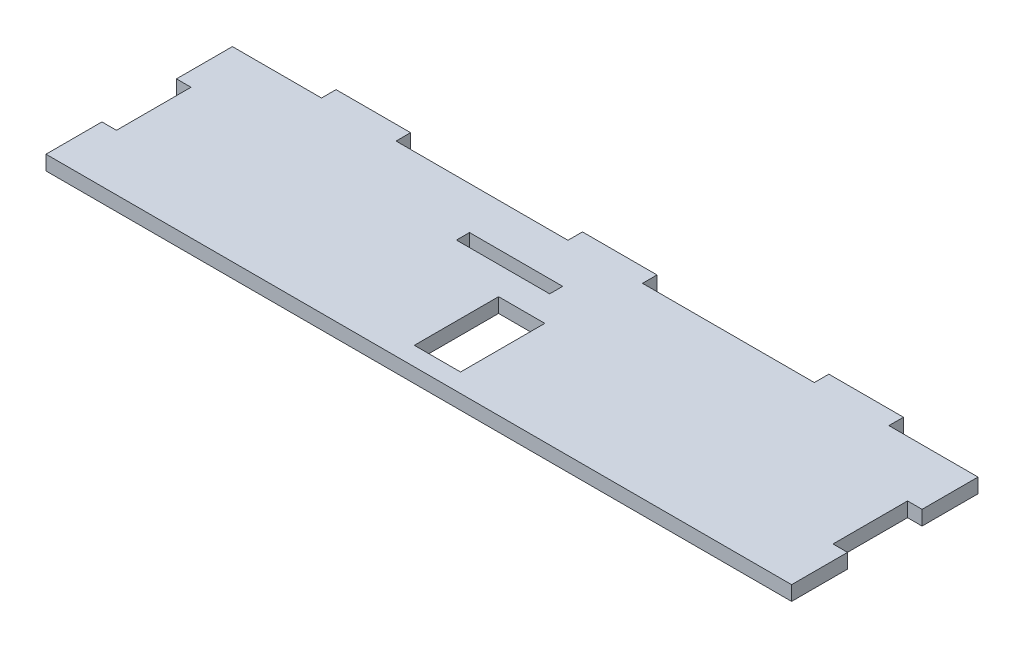
ISO-10303-21;
HEADER;
FILE_DESCRIPTION(('STEP AP214'),'2;1');
FILE_NAME('part.step','',(''),(''),'','','');
FILE_SCHEMA(('AUTOMOTIVE_DESIGN { 1 0 10303 214 1 1 1 1 }'));
ENDSEC;
DATA;
#1=APPLICATION_CONTEXT('core data for automotive mechanical design processes');
#2=APPLICATION_PROTOCOL_DEFINITION('international standard','automotive_design',2000,#1);
#3=PRODUCT_CONTEXT('',#1,'mechanical');
#4=PRODUCT('Part','Part','',(#3));
#5=PRODUCT_RELATED_PRODUCT_CATEGORY('part','',(#4));
#6=PRODUCT_DEFINITION_FORMATION('','',#4);
#7=PRODUCT_DEFINITION_CONTEXT('part definition',#1,'design');
#8=PRODUCT_DEFINITION('design','',#6,#7);
#9=PRODUCT_DEFINITION_SHAPE('','',#8);
#10=(LENGTH_UNIT() NAMED_UNIT(*) SI_UNIT(.MILLI.,.METRE.));
#11=(NAMED_UNIT(*) PLANE_ANGLE_UNIT() SI_UNIT($,.RADIAN.));
#12=(NAMED_UNIT(*) SI_UNIT($,.STERADIAN.) SOLID_ANGLE_UNIT());
#13=UNCERTAINTY_MEASURE_WITH_UNIT(LENGTH_MEASURE(1.E-05),#10,'distance_accuracy_value','');
#14=(GEOMETRIC_REPRESENTATION_CONTEXT(3) GLOBAL_UNCERTAINTY_ASSIGNED_CONTEXT((#13)) GLOBAL_UNIT_ASSIGNED_CONTEXT((#10,
#11,#12)) REPRESENTATION_CONTEXT('',''));
#15=CARTESIAN_POINT('',(0.,0.,0.));
#16=DIRECTION('',(0.,0.,1.));
#17=DIRECTION('',(1.,0.,0.));
#18=AXIS2_PLACEMENT_3D('',#15,#16,#17);
#19=CARTESIAN_POINT('',(0.,3.9,-13.6));
#20=DIRECTION('',(0.,0.,1.));
#21=DIRECTION('',(1.,0.,0.));
#22=AXIS2_PLACEMENT_3D('',#19,#20,#21);
#23=PLANE('',#22);
#24=DIRECTION('',(-1.,0.,0.));
#25=VECTOR('',#24,1.);
#26=CARTESIAN_POINT('',(0.,0.,-13.6));
#27=LINE('',#26,#25);
#28=CARTESIAN_POINT('',(0.,0.,-13.6));
#29=VERTEX_POINT('',#28);
#30=CARTESIAN_POINT('',(-25.,0.,-13.6));
#31=VERTEX_POINT('',#30);
#32=EDGE_CURVE('E497',#29,#31,#27,.T.);
#33=ORIENTED_EDGE('',*,*,#32,.F.);
#34=DIRECTION('',(0.,-1.,0.));
#35=VECTOR('',#34,1.);
#36=CARTESIAN_POINT('',(0.,3.9,-13.6));
#37=LINE('',#36,#35);
#38=CARTESIAN_POINT('',(0.,3.9,-13.6));
#39=VERTEX_POINT('',#38);
#40=EDGE_CURVE('E12',#39,#29,#37,.T.);
#41=ORIENTED_EDGE('',*,*,#40,.F.);
#42=DIRECTION('',(-1.,0.,0.));
#43=VECTOR('',#42,1.);
#44=CARTESIAN_POINT('',(0.,3.9,-13.6));
#45=LINE('',#44,#43);
#46=CARTESIAN_POINT('',(-25.,3.9,-13.6));
#47=VERTEX_POINT('',#46);
#48=EDGE_CURVE('E390',#39,#47,#45,.T.);
#49=ORIENTED_EDGE('',*,*,#48,.T.);
#50=DIRECTION('',(0.,-1.,0.));
#51=VECTOR('',#50,1.);
#52=CARTESIAN_POINT('',(-25.,3.9,-13.6));
#53=LINE('',#52,#51);
#54=EDGE_CURVE('E512',#47,#31,#53,.T.);
#55=ORIENTED_EDGE('',*,*,#54,.T.);
#56=EDGE_LOOP('',(#33,#41,#49,#55));
#57=FACE_BOUND('',#56,.T.);
#58=ADVANCED_FACE('F42',(#57),#23,.T.);
#59=CARTESIAN_POINT('',(0.,3.9,0.));
#60=DIRECTION('',(1.,0.,0.));
#61=DIRECTION('',(0.,0.,-1.));
#62=AXIS2_PLACEMENT_3D('',#59,#60,#61);
#63=PLANE('',#62);
#64=DIRECTION('',(0.,0.,1.));
#65=VECTOR('',#64,1.);
#66=CARTESIAN_POINT('',(0.,0.,0.));
#67=LINE('',#66,#65);
#68=CARTESIAN_POINT('',(0.,0.,-10.1));
#69=VERTEX_POINT('',#68);
#70=EDGE_CURVE('E501',#29,#69,#67,.T.);
#71=ORIENTED_EDGE('',*,*,#70,.T.);
#72=DIRECTION('',(0.,-1.,0.));
#73=VECTOR('',#72,1.);
#74=CARTESIAN_POINT('',(0.,3.9,-10.1));
#75=LINE('',#74,#73);
#76=CARTESIAN_POINT('',(0.,3.9,-10.1));
#77=VERTEX_POINT('',#76);
#78=EDGE_CURVE('E52',#77,#69,#75,.T.);
#79=ORIENTED_EDGE('',*,*,#78,.F.);
#80=DIRECTION('',(0.,0.,1.));
#81=VECTOR('',#80,1.);
#82=CARTESIAN_POINT('',(0.,3.9,0.));
#83=LINE('',#82,#81);
#84=EDGE_CURVE('E394',#39,#77,#83,.T.);
#85=ORIENTED_EDGE('',*,*,#84,.F.);
#86=ORIENTED_EDGE('',*,*,#40,.T.);
#87=EDGE_LOOP('',(#71,#79,#85,#86));
#88=FACE_BOUND('',#87,.T.);
#89=ADVANCED_FACE('F710',(#88),#63,.F.);
#90=CARTESIAN_POINT('',(0.,3.9,-10.1));
#91=DIRECTION('',(0.,0.,1.));
#92=DIRECTION('',(1.,0.,0.));
#93=AXIS2_PLACEMENT_3D('',#90,#91,#92);
#94=PLANE('',#93);
#95=DIRECTION('',(-1.,0.,0.));
#96=VECTOR('',#95,1.);
#97=CARTESIAN_POINT('',(0.,0.,-10.1));
#98=LINE('',#97,#96);
#99=CARTESIAN_POINT('',(-25.,0.,-10.1));
#100=VERTEX_POINT('',#99);
#101=EDGE_CURVE('E505',#69,#100,#98,.T.);
#102=ORIENTED_EDGE('',*,*,#101,.T.);
#103=DIRECTION('',(0.,-1.,0.));
#104=VECTOR('',#103,1.);
#105=CARTESIAN_POINT('',(-25.,3.9,-10.1));
#106=LINE('',#105,#104);
#107=CARTESIAN_POINT('',(-25.,3.9,-10.1));
#108=VERTEX_POINT('',#107);
#109=EDGE_CURVE('E515',#108,#100,#106,.T.);
#110=ORIENTED_EDGE('',*,*,#109,.F.);
#111=DIRECTION('',(-1.,0.,0.));
#112=VECTOR('',#111,1.);
#113=CARTESIAN_POINT('',(0.,3.9,-10.1));
#114=LINE('',#113,#112);
#115=EDGE_CURVE('E398',#77,#108,#114,.T.);
#116=ORIENTED_EDGE('',*,*,#115,.F.);
#117=ORIENTED_EDGE('',*,*,#78,.T.);
#118=EDGE_LOOP('',(#102,#110,#116,#117));
#119=FACE_BOUND('',#118,.T.);
#120=ADVANCED_FACE('F716',(#119),#94,.F.);
#121=CARTESIAN_POINT('',(96.1,3.9,0.));
#122=DIRECTION('',(1.,0.,0.));
#123=DIRECTION('',(0.,0.,-1.));
#124=AXIS2_PLACEMENT_3D('',#121,#122,#123);
#125=PLANE('',#124);
#126=DIRECTION('',(0.,0.,1.));
#127=VECTOR('',#126,1.);
#128=CARTESIAN_POINT('',(96.1,0.,0.));
#129=LINE('',#128,#127);
#130=CARTESIAN_POINT('',(96.1,0.,-10.));
#131=VERTEX_POINT('',#130);
#132=CARTESIAN_POINT('',(96.1,0.,10.));
#133=VERTEX_POINT('',#132);
#134=EDGE_CURVE('E263',#131,#133,#129,.T.);
#135=ORIENTED_EDGE('',*,*,#134,.F.);
#136=DIRECTION('',(0.,-1.,0.));
#137=VECTOR('',#136,1.);
#138=CARTESIAN_POINT('',(96.1,3.9,-10.));
#139=LINE('',#138,#137);
#140=CARTESIAN_POINT('',(96.1,3.9,-10.));
#141=VERTEX_POINT('',#140);
#142=EDGE_CURVE('E46',#141,#131,#139,.T.);
#143=ORIENTED_EDGE('',*,*,#142,.F.);
#144=DIRECTION('',(0.,0.,1.));
#145=VECTOR('',#144,1.);
#146=CARTESIAN_POINT('',(96.1,3.9,0.));
#147=LINE('',#146,#145);
#148=CARTESIAN_POINT('',(96.1,3.9,10.));
#149=VERTEX_POINT('',#148);
#150=EDGE_CURVE('E303',#141,#149,#147,.T.);
#151=ORIENTED_EDGE('',*,*,#150,.T.);
#152=DIRECTION('',(0.,-1.,0.));
#153=VECTOR('',#152,1.);
#154=CARTESIAN_POINT('',(96.1,3.9,10.));
#155=LINE('',#154,#153);
#156=EDGE_CURVE('E405',#149,#133,#155,.T.);
#157=ORIENTED_EDGE('',*,*,#156,.T.);
#158=EDGE_LOOP('',(#135,#143,#151,#157));
#159=FACE_BOUND('',#158,.T.);
#160=ADVANCED_FACE('F44',(#159),#125,.T.);
#161=CARTESIAN_POINT('',(0.,3.9,-10.));
#162=DIRECTION('',(0.,0.,1.));
#163=DIRECTION('',(1.,0.,0.));
#164=AXIS2_PLACEMENT_3D('',#161,#162,#163);
#165=PLANE('',#164);
#166=DIRECTION('',(-1.,0.,0.));
#167=VECTOR('',#166,1.);
#168=CARTESIAN_POINT('',(0.,0.,-10.));
#169=LINE('',#168,#167);
#170=CARTESIAN_POINT('',(100.,0.,-10.));
#171=VERTEX_POINT('',#170);
#172=EDGE_CURVE('E409',#171,#131,#169,.T.);
#173=ORIENTED_EDGE('',*,*,#172,.F.);
#174=DIRECTION('',(0.,-1.,0.));
#175=VECTOR('',#174,1.);
#176=CARTESIAN_POINT('',(100.,3.9,-10.));
#177=LINE('',#176,#175);
#178=CARTESIAN_POINT('',(100.,3.9,-10.));
#179=VERTEX_POINT('',#178);
#180=EDGE_CURVE('E589',#179,#171,#177,.T.);
#181=ORIENTED_EDGE('',*,*,#180,.F.);
#182=DIRECTION('',(-1.,0.,0.));
#183=VECTOR('',#182,1.);
#184=CARTESIAN_POINT('',(0.,3.9,-10.));
#185=LINE('',#184,#183);
#186=EDGE_CURVE('E307',#179,#141,#185,.T.);
#187=ORIENTED_EDGE('',*,*,#186,.T.);
#188=ORIENTED_EDGE('',*,*,#142,.T.);
#189=EDGE_LOOP('',(#173,#181,#187,#188));
#190=FACE_BOUND('',#189,.T.);
#191=ADVANCED_FACE('F597',(#190),#165,.T.);
#192=CARTESIAN_POINT('',(100.,3.9,0.));
#193=DIRECTION('',(1.,0.,0.));
#194=DIRECTION('',(0.,0.,-1.));
#195=AXIS2_PLACEMENT_3D('',#192,#193,#194);
#196=PLANE('',#195);
#197=DIRECTION('',(0.,0.,1.));
#198=VECTOR('',#197,1.);
#199=CARTESIAN_POINT('',(100.,0.,0.));
#200=LINE('',#199,#198);
#201=CARTESIAN_POINT('',(100.,0.,-25.));
#202=VERTEX_POINT('',#201);
#203=EDGE_CURVE('E413',#202,#171,#200,.T.);
#204=ORIENTED_EDGE('',*,*,#203,.F.);
#205=DIRECTION('',(0.,-1.,0.));
#206=VECTOR('',#205,1.);
#207=CARTESIAN_POINT('',(100.,3.9,-25.));
#208=LINE('',#207,#206);
#209=CARTESIAN_POINT('',(100.,3.9,-25.));
#210=VERTEX_POINT('',#209);
#211=EDGE_CURVE('E587',#210,#202,#208,.T.);
#212=ORIENTED_EDGE('',*,*,#211,.F.);
#213=DIRECTION('',(0.,0.,1.));
#214=VECTOR('',#213,1.);
#215=CARTESIAN_POINT('',(100.,3.9,0.));
#216=LINE('',#215,#214);
#217=EDGE_CURVE('E312',#210,#179,#216,.T.);
#218=ORIENTED_EDGE('',*,*,#217,.T.);
#219=ORIENTED_EDGE('',*,*,#180,.T.);
#220=EDGE_LOOP('',(#204,#212,#218,#219));
#221=FACE_BOUND('',#220,.T.);
#222=ADVANCED_FACE('F608',(#221),#196,.T.);
#223=CARTESIAN_POINT('',(0.,3.9,-25.));
#224=DIRECTION('',(0.,0.,-1.));
#225=DIRECTION('',(-1.,0.,0.));
#226=AXIS2_PLACEMENT_3D('',#223,#224,#225);
#227=PLANE('',#226);
#228=DIRECTION('',(1.,0.,0.));
#229=VECTOR('',#228,1.);
#230=CARTESIAN_POINT('',(0.,0.,-25.));
#231=LINE('',#230,#229);
#232=CARTESIAN_POINT('',(76.1,0.,-25.));
#233=VERTEX_POINT('',#232);
#234=EDGE_CURVE('E417',#233,#202,#231,.T.);
#235=ORIENTED_EDGE('',*,*,#234,.F.);
#236=DIRECTION('',(0.,-1.,0.));
#237=VECTOR('',#236,1.);
#238=CARTESIAN_POINT('',(76.1,3.9,-25.));
#239=LINE('',#238,#237);
#240=CARTESIAN_POINT('',(76.1,3.9,-25.));
#241=VERTEX_POINT('',#240);
#242=EDGE_CURVE('E584',#241,#233,#239,.T.);
#243=ORIENTED_EDGE('',*,*,#242,.F.);
#244=DIRECTION('',(1.,0.,0.));
#245=VECTOR('',#244,1.);
#246=CARTESIAN_POINT('',(0.,3.9,-25.));
#247=LINE('',#246,#245);
#248=EDGE_CURVE('E316',#241,#210,#247,.T.);
#249=ORIENTED_EDGE('',*,*,#248,.T.);
#250=ORIENTED_EDGE('',*,*,#211,.T.);
#251=EDGE_LOOP('',(#235,#243,#249,#250));
#252=FACE_BOUND('',#251,.T.);
#253=ADVANCED_FACE('F613',(#252),#227,.T.);
#254=CARTESIAN_POINT('',(76.1,3.9,0.));
#255=DIRECTION('',(-1.,0.,0.));
#256=DIRECTION('',(0.,0.,1.));
#257=AXIS2_PLACEMENT_3D('',#254,#255,#256);
#258=PLANE('',#257);
#259=DIRECTION('',(0.,0.,-1.));
#260=VECTOR('',#259,1.);
#261=CARTESIAN_POINT('',(76.1,0.,0.));
#262=LINE('',#261,#260);
#263=CARTESIAN_POINT('',(76.1,0.,-28.9));
#264=VERTEX_POINT('',#263);
#265=EDGE_CURVE('E421',#233,#264,#262,.T.);
#266=ORIENTED_EDGE('',*,*,#265,.T.);
#267=DIRECTION('',(0.,-1.,0.));
#268=VECTOR('',#267,1.);
#269=CARTESIAN_POINT('',(76.1,3.9,-28.9));
#270=LINE('',#269,#268);
#271=CARTESIAN_POINT('',(76.1,3.9,-28.9));
#272=VERTEX_POINT('',#271);
#273=EDGE_CURVE('E580',#272,#264,#270,.T.);
#274=ORIENTED_EDGE('',*,*,#273,.F.);
#275=DIRECTION('',(0.,0.,-1.));
#276=VECTOR('',#275,1.);
#277=CARTESIAN_POINT('',(76.1,3.9,0.));
#278=LINE('',#277,#276);
#279=EDGE_CURVE('E320',#241,#272,#278,.T.);
#280=ORIENTED_EDGE('',*,*,#279,.F.);
#281=ORIENTED_EDGE('',*,*,#242,.T.);
#282=EDGE_LOOP('',(#266,#274,#280,#281));
#283=FACE_BOUND('',#282,.T.);
#284=ADVANCED_FACE('F617',(#283),#258,.F.);
#285=CARTESIAN_POINT('',(0.,3.9,-28.9));
#286=DIRECTION('',(0.,0.,1.));
#287=DIRECTION('',(1.,0.,0.));
#288=AXIS2_PLACEMENT_3D('',#285,#286,#287);
#289=PLANE('',#288);
#290=DIRECTION('',(-1.,0.,0.));
#291=VECTOR('',#290,1.);
#292=CARTESIAN_POINT('',(0.,0.,-28.9));
#293=LINE('',#292,#291);
#294=CARTESIAN_POINT('',(56.1,0.,-28.9));
#295=VERTEX_POINT('',#294);
#296=EDGE_CURVE('E424',#264,#295,#293,.T.);
#297=ORIENTED_EDGE('',*,*,#296,.T.);
#298=DIRECTION('',(0.,-1.,0.));
#299=VECTOR('',#298,1.);
#300=CARTESIAN_POINT('',(56.1,3.9,-28.9));
#301=LINE('',#300,#299);
#302=CARTESIAN_POINT('',(56.1,3.9,-28.9));
#303=VERTEX_POINT('',#302);
#304=EDGE_CURVE('E577',#303,#295,#301,.T.);
#305=ORIENTED_EDGE('',*,*,#304,.F.);
#306=DIRECTION('',(-1.,0.,0.));
#307=VECTOR('',#306,1.);
#308=CARTESIAN_POINT('',(0.,3.9,-28.9));
#309=LINE('',#308,#307);
#310=EDGE_CURVE('E323',#272,#303,#309,.T.);
#311=ORIENTED_EDGE('',*,*,#310,.F.);
#312=ORIENTED_EDGE('',*,*,#273,.T.);
#313=EDGE_LOOP('',(#297,#305,#311,#312));
#314=FACE_BOUND('',#313,.T.);
#315=ADVANCED_FACE('F623',(#314),#289,.F.);
#316=CARTESIAN_POINT('',(56.1,3.9,0.));
#317=DIRECTION('',(-1.,0.,0.));
#318=DIRECTION('',(0.,0.,1.));
#319=AXIS2_PLACEMENT_3D('',#316,#317,#318);
#320=PLANE('',#319);
#321=DIRECTION('',(0.,0.,-1.));
#322=VECTOR('',#321,1.);
#323=CARTESIAN_POINT('',(56.1,0.,0.));
#324=LINE('',#323,#322);
#325=CARTESIAN_POINT('',(56.1,0.,-25.));
#326=VERTEX_POINT('',#325);
#327=EDGE_CURVE('E428',#326,#295,#324,.T.);
#328=ORIENTED_EDGE('',*,*,#327,.F.);
#329=DIRECTION('',(0.,-1.,0.));
#330=VECTOR('',#329,1.);
#331=CARTESIAN_POINT('',(56.1,3.9,-25.));
#332=LINE('',#331,#330);
#333=CARTESIAN_POINT('',(56.1,3.9,-25.));
#334=VERTEX_POINT('',#333);
#335=EDGE_CURVE('E574',#334,#326,#332,.T.);
#336=ORIENTED_EDGE('',*,*,#335,.F.);
#337=DIRECTION('',(0.,0.,-1.));
#338=VECTOR('',#337,1.);
#339=CARTESIAN_POINT('',(56.1,3.9,0.));
#340=LINE('',#339,#338);
#341=EDGE_CURVE('E326',#334,#303,#340,.T.);
#342=ORIENTED_EDGE('',*,*,#341,.T.);
#343=ORIENTED_EDGE('',*,*,#304,.T.);
#344=EDGE_LOOP('',(#328,#336,#342,#343));
#345=FACE_BOUND('',#344,.T.);
#346=ADVANCED_FACE('F627',(#345),#320,.T.);
#347=CARTESIAN_POINT('',(0.,3.9,-25.));
#348=DIRECTION('',(0.,0.,-1.));
#349=DIRECTION('',(-1.,0.,0.));
#350=AXIS2_PLACEMENT_3D('',#347,#348,#349);
#351=PLANE('',#350);
#352=DIRECTION('',(1.,0.,0.));
#353=VECTOR('',#352,1.);
#354=CARTESIAN_POINT('',(0.,0.,-25.));
#355=LINE('',#354,#353);
#356=CARTESIAN_POINT('',(10.,0.,-25.));
#357=VERTEX_POINT('',#356);
#358=EDGE_CURVE('E432',#357,#326,#355,.T.);
#359=ORIENTED_EDGE('',*,*,#358,.F.);
#360=DIRECTION('',(0.,-1.,0.));
#361=VECTOR('',#360,1.);
#362=CARTESIAN_POINT('',(10.,3.9,-25.));
#363=LINE('',#362,#361);
#364=CARTESIAN_POINT('',(10.,3.9,-25.));
#365=VERTEX_POINT('',#364);
#366=EDGE_CURVE('E571',#365,#357,#363,.T.);
#367=ORIENTED_EDGE('',*,*,#366,.F.);
#368=DIRECTION('',(1.,0.,0.));
#369=VECTOR('',#368,1.);
#370=CARTESIAN_POINT('',(0.,3.9,-25.));
#371=LINE('',#370,#369);
#372=EDGE_CURVE('E330',#365,#334,#371,.T.);
#373=ORIENTED_EDGE('',*,*,#372,.T.);
#374=ORIENTED_EDGE('',*,*,#335,.T.);
#375=EDGE_LOOP('',(#359,#367,#373,#374));
#376=FACE_BOUND('',#375,.T.);
#377=ADVANCED_FACE('F630',(#376),#351,.T.);
#378=CARTESIAN_POINT('',(10.,3.9,0.));
#379=DIRECTION('',(1.,0.,0.));
#380=DIRECTION('',(0.,0.,-1.));
#381=AXIS2_PLACEMENT_3D('',#378,#379,#380);
#382=PLANE('',#381);
#383=DIRECTION('',(0.,0.,1.));
#384=VECTOR('',#383,1.);
#385=CARTESIAN_POINT('',(10.,0.,0.));
#386=LINE('',#385,#384);
#387=CARTESIAN_POINT('',(10.,0.,-28.9));
#388=VERTEX_POINT('',#387);
#389=EDGE_CURVE('E436',#388,#357,#386,.T.);
#390=ORIENTED_EDGE('',*,*,#389,.F.);
#391=DIRECTION('',(0.,-1.,0.));
#392=VECTOR('',#391,1.);
#393=CARTESIAN_POINT('',(10.,3.9,-28.9));
#394=LINE('',#393,#392);
#395=CARTESIAN_POINT('',(10.,3.9,-28.9));
#396=VERTEX_POINT('',#395);
#397=EDGE_CURVE('E568',#396,#388,#394,.T.);
#398=ORIENTED_EDGE('',*,*,#397,.F.);
#399=DIRECTION('',(0.,0.,1.));
#400=VECTOR('',#399,1.);
#401=CARTESIAN_POINT('',(10.,3.9,0.));
#402=LINE('',#401,#400);
#403=EDGE_CURVE('E334',#396,#365,#402,.T.);
#404=ORIENTED_EDGE('',*,*,#403,.T.);
#405=ORIENTED_EDGE('',*,*,#366,.T.);
#406=EDGE_LOOP('',(#390,#398,#404,#405));
#407=FACE_BOUND('',#406,.T.);
#408=ADVANCED_FACE('F635',(#407),#382,.T.);
#409=CARTESIAN_POINT('',(0.,3.9,-28.9));
#410=DIRECTION('',(0.,0.,-1.));
#411=DIRECTION('',(-1.,0.,0.));
#412=AXIS2_PLACEMENT_3D('',#409,#410,#411);
#413=PLANE('',#412);
#414=DIRECTION('',(1.,0.,0.));
#415=VECTOR('',#414,1.);
#416=CARTESIAN_POINT('',(0.,0.,-28.9));
#417=LINE('',#416,#415);
#418=CARTESIAN_POINT('',(-10.,0.,-28.9));
#419=VERTEX_POINT('',#418);
#420=EDGE_CURVE('E440',#419,#388,#417,.T.);
#421=ORIENTED_EDGE('',*,*,#420,.F.);
#422=DIRECTION('',(0.,-1.,0.));
#423=VECTOR('',#422,1.);
#424=CARTESIAN_POINT('',(-10.,3.9,-28.9));
#425=LINE('',#424,#423);
#426=CARTESIAN_POINT('',(-10.,3.9,-28.9));
#427=VERTEX_POINT('',#426);
#428=EDGE_CURVE('E565',#427,#419,#425,.T.);
#429=ORIENTED_EDGE('',*,*,#428,.F.);
#430=DIRECTION('',(1.,0.,0.));
#431=VECTOR('',#430,1.);
#432=CARTESIAN_POINT('',(0.,3.9,-28.9));
#433=LINE('',#432,#431);
#434=EDGE_CURVE('E338',#427,#396,#433,.T.);
#435=ORIENTED_EDGE('',*,*,#434,.T.);
#436=ORIENTED_EDGE('',*,*,#397,.T.);
#437=EDGE_LOOP('',(#421,#429,#435,#436));
#438=FACE_BOUND('',#437,.T.);
#439=ADVANCED_FACE('F638',(#438),#413,.T.);
#440=CARTESIAN_POINT('',(-10.,3.9,0.));
#441=DIRECTION('',(1.,0.,0.));
#442=DIRECTION('',(0.,0.,-1.));
#443=AXIS2_PLACEMENT_3D('',#440,#441,#442);
#444=PLANE('',#443);
#445=DIRECTION('',(0.,0.,1.));
#446=VECTOR('',#445,1.);
#447=CARTESIAN_POINT('',(-10.,0.,0.));
#448=LINE('',#447,#446);
#449=CARTESIAN_POINT('',(-10.,0.,-25.));
#450=VERTEX_POINT('',#449);
#451=EDGE_CURVE('E444',#419,#450,#448,.T.);
#452=ORIENTED_EDGE('',*,*,#451,.T.);
#453=DIRECTION('',(0.,-1.,0.));
#454=VECTOR('',#453,1.);
#455=CARTESIAN_POINT('',(-10.,3.9,-25.));
#456=LINE('',#455,#454);
#457=CARTESIAN_POINT('',(-10.,3.9,-25.));
#458=VERTEX_POINT('',#457);
#459=EDGE_CURVE('E562',#458,#450,#456,.T.);
#460=ORIENTED_EDGE('',*,*,#459,.F.);
#461=DIRECTION('',(0.,0.,1.));
#462=VECTOR('',#461,1.);
#463=CARTESIAN_POINT('',(-10.,3.9,0.));
#464=LINE('',#463,#462);
#465=EDGE_CURVE('E342',#427,#458,#464,.T.);
#466=ORIENTED_EDGE('',*,*,#465,.F.);
#467=ORIENTED_EDGE('',*,*,#428,.T.);
#468=EDGE_LOOP('',(#452,#460,#466,#467));
#469=FACE_BOUND('',#468,.T.);
#470=ADVANCED_FACE('F643',(#469),#444,.F.);
#471=CARTESIAN_POINT('',(0.,3.9,-25.));
#472=DIRECTION('',(0.,0.,-1.));
#473=DIRECTION('',(-1.,0.,0.));
#474=AXIS2_PLACEMENT_3D('',#471,#472,#473);
#475=PLANE('',#474);
#476=DIRECTION('',(1.,0.,0.));
#477=VECTOR('',#476,1.);
#478=CARTESIAN_POINT('',(0.,0.,-25.));
#479=LINE('',#478,#477);
#480=CARTESIAN_POINT('',(-56.1,0.,-25.));
#481=VERTEX_POINT('',#480);
#482=EDGE_CURVE('E448',#481,#450,#479,.T.);
#483=ORIENTED_EDGE('',*,*,#482,.F.);
#484=DIRECTION('',(0.,-1.,0.));
#485=VECTOR('',#484,1.);
#486=CARTESIAN_POINT('',(-56.1,3.9,-25.));
#487=LINE('',#486,#485);
#488=CARTESIAN_POINT('',(-56.1,3.9,-25.));
#489=VERTEX_POINT('',#488);
#490=EDGE_CURVE('E559',#489,#481,#487,.T.);
#491=ORIENTED_EDGE('',*,*,#490,.F.);
#492=DIRECTION('',(1.,0.,0.));
#493=VECTOR('',#492,1.);
#494=CARTESIAN_POINT('',(0.,3.9,-25.));
#495=LINE('',#494,#493);
#496=EDGE_CURVE('E345',#489,#458,#495,.T.);
#497=ORIENTED_EDGE('',*,*,#496,.T.);
#498=ORIENTED_EDGE('',*,*,#459,.T.);
#499=EDGE_LOOP('',(#483,#491,#497,#498));
#500=FACE_BOUND('',#499,.T.);
#501=ADVANCED_FACE('F647',(#500),#475,.T.);
#502=CARTESIAN_POINT('',(-56.1,3.9,0.));
#503=DIRECTION('',(-1.,0.,0.));
#504=DIRECTION('',(0.,0.,1.));
#505=AXIS2_PLACEMENT_3D('',#502,#503,#504);
#506=PLANE('',#505);
#507=DIRECTION('',(0.,0.,-1.));
#508=VECTOR('',#507,1.);
#509=CARTESIAN_POINT('',(-56.1,0.,0.));
#510=LINE('',#509,#508);
#511=CARTESIAN_POINT('',(-56.1,0.,-28.9));
#512=VERTEX_POINT('',#511);
#513=EDGE_CURVE('E452',#481,#512,#510,.T.);
#514=ORIENTED_EDGE('',*,*,#513,.T.);
#515=DIRECTION('',(0.,-1.,0.));
#516=VECTOR('',#515,1.);
#517=CARTESIAN_POINT('',(-56.1,3.9,-28.9));
#518=LINE('',#517,#516);
#519=CARTESIAN_POINT('',(-56.1,3.9,-28.9));
#520=VERTEX_POINT('',#519);
#521=EDGE_CURVE('E556',#520,#512,#518,.T.);
#522=ORIENTED_EDGE('',*,*,#521,.F.);
#523=DIRECTION('',(0.,0.,-1.));
#524=VECTOR('',#523,1.);
#525=CARTESIAN_POINT('',(-56.1,3.9,0.));
#526=LINE('',#525,#524);
#527=EDGE_CURVE('E349',#489,#520,#526,.T.);
#528=ORIENTED_EDGE('',*,*,#527,.F.);
#529=ORIENTED_EDGE('',*,*,#490,.T.);
#530=EDGE_LOOP('',(#514,#522,#528,#529));
#531=FACE_BOUND('',#530,.T.);
#532=ADVANCED_FACE('F652',(#531),#506,.F.);
#533=CARTESIAN_POINT('',(0.,3.9,-28.9));
#534=DIRECTION('',(0.,0.,-1.));
#535=DIRECTION('',(-1.,0.,0.));
#536=AXIS2_PLACEMENT_3D('',#533,#534,#535);
#537=PLANE('',#536);
#538=DIRECTION('',(1.,0.,0.));
#539=VECTOR('',#538,1.);
#540=CARTESIAN_POINT('',(0.,0.,-28.9));
#541=LINE('',#540,#539);
#542=CARTESIAN_POINT('',(-76.1,0.,-28.9));
#543=VERTEX_POINT('',#542);
#544=EDGE_CURVE('E456',#543,#512,#541,.T.);
#545=ORIENTED_EDGE('',*,*,#544,.F.);
#546=DIRECTION('',(0.,-1.,0.));
#547=VECTOR('',#546,1.);
#548=CARTESIAN_POINT('',(-76.1,3.9,-28.9));
#549=LINE('',#548,#547);
#550=CARTESIAN_POINT('',(-76.1,3.9,-28.9));
#551=VERTEX_POINT('',#550);
#552=EDGE_CURVE('E553',#551,#543,#549,.T.);
#553=ORIENTED_EDGE('',*,*,#552,.F.);
#554=DIRECTION('',(1.,0.,0.));
#555=VECTOR('',#554,1.);
#556=CARTESIAN_POINT('',(0.,3.9,-28.9));
#557=LINE('',#556,#555);
#558=EDGE_CURVE('E352',#551,#520,#557,.T.);
#559=ORIENTED_EDGE('',*,*,#558,.T.);
#560=ORIENTED_EDGE('',*,*,#521,.T.);
#561=EDGE_LOOP('',(#545,#553,#559,#560));
#562=FACE_BOUND('',#561,.T.);
#563=ADVANCED_FACE('F700',(#562),#537,.T.);
#564=CARTESIAN_POINT('',(-76.1,3.9,0.));
#565=DIRECTION('',(-1.,0.,0.));
#566=DIRECTION('',(0.,0.,1.));
#567=AXIS2_PLACEMENT_3D('',#564,#565,#566);
#568=PLANE('',#567);
#569=DIRECTION('',(0.,0.,-1.));
#570=VECTOR('',#569,1.);
#571=CARTESIAN_POINT('',(-76.1,0.,0.));
#572=LINE('',#571,#570);
#573=CARTESIAN_POINT('',(-76.1,0.,-25.));
#574=VERTEX_POINT('',#573);
#575=EDGE_CURVE('E460',#574,#543,#572,.T.);
#576=ORIENTED_EDGE('',*,*,#575,.F.);
#577=DIRECTION('',(0.,-1.,0.));
#578=VECTOR('',#577,1.);
#579=CARTESIAN_POINT('',(-76.1,3.9,-25.));
#580=LINE('',#579,#578);
#581=CARTESIAN_POINT('',(-76.1,3.9,-25.));
#582=VERTEX_POINT('',#581);
#583=EDGE_CURVE('E550',#582,#574,#580,.T.);
#584=ORIENTED_EDGE('',*,*,#583,.F.);
#585=DIRECTION('',(0.,0.,-1.));
#586=VECTOR('',#585,1.);
#587=CARTESIAN_POINT('',(-76.1,3.9,0.));
#588=LINE('',#587,#586);
#589=EDGE_CURVE('E356',#582,#551,#588,.T.);
#590=ORIENTED_EDGE('',*,*,#589,.T.);
#591=ORIENTED_EDGE('',*,*,#552,.T.);
#592=EDGE_LOOP('',(#576,#584,#590,#591));
#593=FACE_BOUND('',#592,.T.);
#594=ADVANCED_FACE('F659',(#593),#568,.T.);
#595=CARTESIAN_POINT('',(0.,3.9,-25.));
#596=DIRECTION('',(0.,0.,-1.));
#597=DIRECTION('',(-1.,0.,0.));
#598=AXIS2_PLACEMENT_3D('',#595,#596,#597);
#599=PLANE('',#598);
#600=DIRECTION('',(1.,0.,0.));
#601=VECTOR('',#600,1.);
#602=CARTESIAN_POINT('',(0.,0.,-25.));
#603=LINE('',#602,#601);
#604=CARTESIAN_POINT('',(-100.,0.,-25.));
#605=VERTEX_POINT('',#604);
#606=EDGE_CURVE('E464',#605,#574,#603,.T.);
#607=ORIENTED_EDGE('',*,*,#606,.F.);
#608=DIRECTION('',(0.,-1.,0.));
#609=VECTOR('',#608,1.);
#610=CARTESIAN_POINT('',(-100.,3.9,-25.));
#611=LINE('',#610,#609);
#612=CARTESIAN_POINT('',(-100.,3.9,-25.));
#613=VERTEX_POINT('',#612);
#614=EDGE_CURVE('E547',#613,#605,#611,.T.);
#615=ORIENTED_EDGE('',*,*,#614,.F.);
#616=DIRECTION('',(1.,0.,0.));
#617=VECTOR('',#616,1.);
#618=CARTESIAN_POINT('',(0.,3.9,-25.));
#619=LINE('',#618,#617);
#620=EDGE_CURVE('E360',#613,#582,#619,.T.);
#621=ORIENTED_EDGE('',*,*,#620,.T.);
#622=ORIENTED_EDGE('',*,*,#583,.T.);
#623=EDGE_LOOP('',(#607,#615,#621,#622));
#624=FACE_BOUND('',#623,.T.);
#625=ADVANCED_FACE('F663',(#624),#599,.T.);
#626=CARTESIAN_POINT('',(-100.,3.9,0.));
#627=DIRECTION('',(1.,0.,0.));
#628=DIRECTION('',(0.,0.,-1.));
#629=AXIS2_PLACEMENT_3D('',#626,#627,#628);
#630=PLANE('',#629);
#631=DIRECTION('',(0.,0.,1.));
#632=VECTOR('',#631,1.);
#633=CARTESIAN_POINT('',(-100.,0.,0.));
#634=LINE('',#633,#632);
#635=CARTESIAN_POINT('',(-100.,0.,-10.));
#636=VERTEX_POINT('',#635);
#637=EDGE_CURVE('E468',#605,#636,#634,.T.);
#638=ORIENTED_EDGE('',*,*,#637,.T.);
#639=DIRECTION('',(0.,-1.,0.));
#640=VECTOR('',#639,1.);
#641=CARTESIAN_POINT('',(-100.,3.9,-10.));
#642=LINE('',#641,#640);
#643=CARTESIAN_POINT('',(-100.,3.9,-10.));
#644=VERTEX_POINT('',#643);
#645=EDGE_CURVE('E543',#644,#636,#642,.T.);
#646=ORIENTED_EDGE('',*,*,#645,.F.);
#647=DIRECTION('',(0.,0.,1.));
#648=VECTOR('',#647,1.);
#649=CARTESIAN_POINT('',(-100.,3.9,0.));
#650=LINE('',#649,#648);
#651=EDGE_CURVE('E364',#613,#644,#650,.T.);
#652=ORIENTED_EDGE('',*,*,#651,.F.);
#653=ORIENTED_EDGE('',*,*,#614,.T.);
#654=EDGE_LOOP('',(#638,#646,#652,#653));
#655=FACE_BOUND('',#654,.T.);
#656=ADVANCED_FACE('F669',(#655),#630,.F.);
#657=CARTESIAN_POINT('',(0.,3.9,-10.));
#658=DIRECTION('',(0.,0.,-1.));
#659=DIRECTION('',(-1.,0.,0.));
#660=AXIS2_PLACEMENT_3D('',#657,#658,#659);
#661=PLANE('',#660);
#662=DIRECTION('',(1.,0.,0.));
#663=VECTOR('',#662,1.);
#664=CARTESIAN_POINT('',(0.,0.,-10.));
#665=LINE('',#664,#663);
#666=CARTESIAN_POINT('',(-96.1,0.,-10.));
#667=VERTEX_POINT('',#666);
#668=EDGE_CURVE('E471',#636,#667,#665,.T.);
#669=ORIENTED_EDGE('',*,*,#668,.T.);
#670=DIRECTION('',(0.,-1.,0.));
#671=VECTOR('',#670,1.);
#672=CARTESIAN_POINT('',(-96.1,3.9,-10.));
#673=LINE('',#672,#671);
#674=CARTESIAN_POINT('',(-96.1,3.9,-10.));
#675=VERTEX_POINT('',#674);
#676=EDGE_CURVE('E539',#675,#667,#673,.T.);
#677=ORIENTED_EDGE('',*,*,#676,.F.);
#678=DIRECTION('',(1.,0.,0.));
#679=VECTOR('',#678,1.);
#680=CARTESIAN_POINT('',(0.,3.9,-10.));
#681=LINE('',#680,#679);
#682=EDGE_CURVE('E367',#644,#675,#681,.T.);
#683=ORIENTED_EDGE('',*,*,#682,.F.);
#684=ORIENTED_EDGE('',*,*,#645,.T.);
#685=EDGE_LOOP('',(#669,#677,#683,#684));
#686=FACE_BOUND('',#685,.T.);
#687=ADVANCED_FACE('F673',(#686),#661,.F.);
#688=CARTESIAN_POINT('',(-96.1,3.9,0.));
#689=DIRECTION('',(1.,0.,0.));
#690=DIRECTION('',(0.,0.,-1.));
#691=AXIS2_PLACEMENT_3D('',#688,#689,#690);
#692=PLANE('',#691);
#693=DIRECTION('',(0.,0.,1.));
#694=VECTOR('',#693,1.);
#695=CARTESIAN_POINT('',(-96.1,0.,0.));
#696=LINE('',#695,#694);
#697=CARTESIAN_POINT('',(-96.1,0.,10.));
#698=VERTEX_POINT('',#697);
#699=EDGE_CURVE('E474',#667,#698,#696,.T.);
#700=ORIENTED_EDGE('',*,*,#699,.T.);
#701=DIRECTION('',(0.,-1.,0.));
#702=VECTOR('',#701,1.);
#703=CARTESIAN_POINT('',(-96.1,3.9,10.));
#704=LINE('',#703,#702);
#705=CARTESIAN_POINT('',(-96.1,3.9,10.));
#706=VERTEX_POINT('',#705);
#707=EDGE_CURVE('E536',#706,#698,#704,.T.);
#708=ORIENTED_EDGE('',*,*,#707,.F.);
#709=DIRECTION('',(0.,0.,1.));
#710=VECTOR('',#709,1.);
#711=CARTESIAN_POINT('',(-96.1,3.9,0.));
#712=LINE('',#711,#710);
#713=EDGE_CURVE('E370',#675,#706,#712,.T.);
#714=ORIENTED_EDGE('',*,*,#713,.F.);
#715=ORIENTED_EDGE('',*,*,#676,.T.);
#716=EDGE_LOOP('',(#700,#708,#714,#715));
#717=FACE_BOUND('',#716,.T.);
#718=ADVANCED_FACE('F678',(#717),#692,.F.);
#719=CARTESIAN_POINT('',(0.,3.9,10.));
#720=DIRECTION('',(0.,0.,-1.));
#721=DIRECTION('',(-1.,0.,0.));
#722=AXIS2_PLACEMENT_3D('',#719,#720,#721);
#723=PLANE('',#722);
#724=DIRECTION('',(1.,0.,0.));
#725=VECTOR('',#724,1.);
#726=CARTESIAN_POINT('',(0.,0.,10.));
#727=LINE('',#726,#725);
#728=CARTESIAN_POINT('',(-100.,0.,10.));
#729=VERTEX_POINT('',#728);
#730=EDGE_CURVE('E478',#729,#698,#727,.T.);
#731=ORIENTED_EDGE('',*,*,#730,.F.);
#732=DIRECTION('',(0.,-1.,0.));
#733=VECTOR('',#732,1.);
#734=CARTESIAN_POINT('',(-100.,3.9,10.));
#735=LINE('',#734,#733);
#736=CARTESIAN_POINT('',(-100.,3.9,10.));
#737=VERTEX_POINT('',#736);
#738=EDGE_CURVE('E533',#737,#729,#735,.T.);
#739=ORIENTED_EDGE('',*,*,#738,.F.);
#740=DIRECTION('',(1.,0.,0.));
#741=VECTOR('',#740,1.);
#742=CARTESIAN_POINT('',(0.,3.9,10.));
#743=LINE('',#742,#741);
#744=EDGE_CURVE('E373',#737,#706,#743,.T.);
#745=ORIENTED_EDGE('',*,*,#744,.T.);
#746=ORIENTED_EDGE('',*,*,#707,.T.);
#747=EDGE_LOOP('',(#731,#739,#745,#746));
#748=FACE_BOUND('',#747,.T.);
#749=ADVANCED_FACE('F684',(#748),#723,.T.);
#750=CARTESIAN_POINT('',(-100.,3.9,0.));
#751=DIRECTION('',(1.,0.,0.));
#752=DIRECTION('',(0.,0.,-1.));
#753=AXIS2_PLACEMENT_3D('',#750,#751,#752);
#754=PLANE('',#753);
#755=DIRECTION('',(0.,0.,1.));
#756=VECTOR('',#755,1.);
#757=CARTESIAN_POINT('',(-100.,0.,0.));
#758=LINE('',#757,#756);
#759=CARTESIAN_POINT('',(-100.,0.,25.));
#760=VERTEX_POINT('',#759);
#761=EDGE_CURVE('E482',#729,#760,#758,.T.);
#762=ORIENTED_EDGE('',*,*,#761,.T.);
#763=DIRECTION('',(0.,-1.,0.));
#764=VECTOR('',#763,1.);
#765=CARTESIAN_POINT('',(-100.,3.9,25.));
#766=LINE('',#765,#764);
#767=CARTESIAN_POINT('',(-100.,3.9,25.));
#768=VERTEX_POINT('',#767);
#769=EDGE_CURVE('E529',#768,#760,#766,.T.);
#770=ORIENTED_EDGE('',*,*,#769,.F.);
#771=DIRECTION('',(0.,0.,1.));
#772=VECTOR('',#771,1.);
#773=CARTESIAN_POINT('',(-100.,3.9,0.));
#774=LINE('',#773,#772);
#775=EDGE_CURVE('E377',#737,#768,#774,.T.);
#776=ORIENTED_EDGE('',*,*,#775,.F.);
#777=ORIENTED_EDGE('',*,*,#738,.T.);
#778=EDGE_LOOP('',(#762,#770,#776,#777));
#779=FACE_BOUND('',#778,.T.);
#780=ADVANCED_FACE('F687',(#779),#754,.F.);
#781=CARTESIAN_POINT('',(0.,3.9,25.));
#782=DIRECTION('',(0.,0.,-1.));
#783=DIRECTION('',(-1.,0.,0.));
#784=AXIS2_PLACEMENT_3D('',#781,#782,#783);
#785=PLANE('',#784);
#786=DIRECTION('',(1.,0.,0.));
#787=VECTOR('',#786,1.);
#788=CARTESIAN_POINT('',(0.,0.,25.));
#789=LINE('',#788,#787);
#790=CARTESIAN_POINT('',(100.,0.,25.));
#791=VERTEX_POINT('',#790);
#792=EDGE_CURVE('E485',#760,#791,#789,.T.);
#793=ORIENTED_EDGE('',*,*,#792,.T.);
#794=DIRECTION('',(0.,-1.,0.));
#795=VECTOR('',#794,1.);
#796=CARTESIAN_POINT('',(100.,3.9,25.));
#797=LINE('',#796,#795);
#798=CARTESIAN_POINT('',(100.,3.9,25.));
#799=VERTEX_POINT('',#798);
#800=EDGE_CURVE('E526',#799,#791,#797,.T.);
#801=ORIENTED_EDGE('',*,*,#800,.F.);
#802=DIRECTION('',(1.,0.,0.));
#803=VECTOR('',#802,1.);
#804=CARTESIAN_POINT('',(0.,3.9,25.));
#805=LINE('',#804,#803);
#806=EDGE_CURVE('E380',#768,#799,#805,.T.);
#807=ORIENTED_EDGE('',*,*,#806,.F.);
#808=ORIENTED_EDGE('',*,*,#769,.T.);
#809=EDGE_LOOP('',(#793,#801,#807,#808));
#810=FACE_BOUND('',#809,.T.);
#811=ADVANCED_FACE('F692',(#810),#785,.F.);
#812=CARTESIAN_POINT('',(100.,3.9,0.));
#813=DIRECTION('',(1.,0.,0.));
#814=DIRECTION('',(0.,0.,-1.));
#815=AXIS2_PLACEMENT_3D('',#812,#813,#814);
#816=PLANE('',#815);
#817=DIRECTION('',(0.,0.,1.));
#818=VECTOR('',#817,1.);
#819=CARTESIAN_POINT('',(100.,0.,0.));
#820=LINE('',#819,#818);
#821=CARTESIAN_POINT('',(100.,0.,10.));
#822=VERTEX_POINT('',#821);
#823=EDGE_CURVE('E489',#822,#791,#820,.T.);
#824=ORIENTED_EDGE('',*,*,#823,.F.);
#825=DIRECTION('',(0.,-1.,0.));
#826=VECTOR('',#825,1.);
#827=CARTESIAN_POINT('',(100.,3.9,10.));
#828=LINE('',#827,#826);
#829=CARTESIAN_POINT('',(100.,3.9,10.));
#830=VERTEX_POINT('',#829);
#831=EDGE_CURVE('E523',#830,#822,#828,.T.);
#832=ORIENTED_EDGE('',*,*,#831,.F.);
#833=DIRECTION('',(0.,0.,1.));
#834=VECTOR('',#833,1.);
#835=CARTESIAN_POINT('',(100.,3.9,0.));
#836=LINE('',#835,#834);
#837=EDGE_CURVE('E383',#830,#799,#836,.T.);
#838=ORIENTED_EDGE('',*,*,#837,.T.);
#839=ORIENTED_EDGE('',*,*,#800,.T.);
#840=EDGE_LOOP('',(#824,#832,#838,#839));
#841=FACE_BOUND('',#840,.T.);
#842=ADVANCED_FACE('F697',(#841),#816,.T.);
#843=CARTESIAN_POINT('',(0.,3.9,10.));
#844=DIRECTION('',(0.,0.,1.));
#845=DIRECTION('',(1.,0.,0.));
#846=AXIS2_PLACEMENT_3D('',#843,#844,#845);
#847=PLANE('',#846);
#848=DIRECTION('',(-1.,0.,0.));
#849=VECTOR('',#848,1.);
#850=CARTESIAN_POINT('',(0.,0.,10.));
#851=LINE('',#850,#849);
#852=EDGE_CURVE('E493',#822,#133,#851,.T.);
#853=ORIENTED_EDGE('',*,*,#852,.T.);
#854=ORIENTED_EDGE('',*,*,#156,.F.);
#855=DIRECTION('',(-1.,0.,0.));
#856=VECTOR('',#855,1.);
#857=CARTESIAN_POINT('',(0.,3.9,10.));
#858=LINE('',#857,#856);
#859=EDGE_CURVE('E387',#830,#149,#858,.T.);
#860=ORIENTED_EDGE('',*,*,#859,.F.);
#861=ORIENTED_EDGE('',*,*,#831,.T.);
#862=EDGE_LOOP('',(#853,#854,#860,#861));
#863=FACE_BOUND('',#862,.T.);
#864=ADVANCED_FACE('F699',(#863),#847,.F.);
#865=CARTESIAN_POINT('',(-25.,3.9,0.));
#866=DIRECTION('',(1.,0.,0.));
#867=DIRECTION('',(0.,0.,-1.));
#868=AXIS2_PLACEMENT_3D('',#865,#866,#867);
#869=PLANE('',#868);
#870=DIRECTION('',(0.,0.,1.));
#871=VECTOR('',#870,1.);
#872=CARTESIAN_POINT('',(-25.,0.,0.));
#873=LINE('',#872,#871);
#874=EDGE_CURVE('E308',#31,#100,#873,.T.);
#875=ORIENTED_EDGE('',*,*,#874,.F.);
#876=ORIENTED_EDGE('',*,*,#54,.F.);
#877=DIRECTION('',(0.,0.,1.));
#878=VECTOR('',#877,1.);
#879=CARTESIAN_POINT('',(-25.,3.9,0.));
#880=LINE('',#879,#878);
#881=EDGE_CURVE('E401',#47,#108,#880,.T.);
#882=ORIENTED_EDGE('',*,*,#881,.T.);
#883=ORIENTED_EDGE('',*,*,#109,.T.);
#884=EDGE_LOOP('',(#875,#876,#882,#883));
#885=FACE_BOUND('',#884,.T.);
#886=ADVANCED_FACE('F724',(#885),#869,.T.);
#887=CARTESIAN_POINT('',(0.,3.9,0.));
#888=DIRECTION('',(0.,1.,0.));
#889=DIRECTION('',(0.,0.,1.));
#890=AXIS2_PLACEMENT_3D('',#887,#888,#889);
#891=PLANE('',#890);
#892=DIRECTION('',(0.,0.,1.));
#893=VECTOR('',#892,1.);
#894=CARTESIAN_POINT('',(6.2,3.9,0.));
#895=LINE('',#894,#893);
#896=CARTESIAN_POINT('',(6.2,3.9,-2.6));
#897=VERTEX_POINT('',#896);
#898=CARTESIAN_POINT('',(6.2,3.9,20.));
#899=VERTEX_POINT('',#898);
#900=EDGE_CURVE('E267',#897,#899,#895,.T.);
#901=ORIENTED_EDGE('',*,*,#900,.T.);
#902=DIRECTION('',(1.,0.,0.));
#903=VECTOR('',#902,1.);
#904=CARTESIAN_POINT('',(0.,3.9,20.));
#905=LINE('',#904,#903);
#906=CARTESIAN_POINT('',(-6.2,3.9,20.));
#907=VERTEX_POINT('',#906);
#908=EDGE_CURVE('E281',#907,#899,#905,.T.);
#909=ORIENTED_EDGE('',*,*,#908,.F.);
#910=DIRECTION('',(0.,0.,1.));
#911=VECTOR('',#910,1.);
#912=CARTESIAN_POINT('',(-6.2,3.9,0.));
#913=LINE('',#912,#911);
#914=CARTESIAN_POINT('',(-6.2,3.9,-2.6));
#915=VERTEX_POINT('',#914);
#916=EDGE_CURVE('E277',#915,#907,#913,.T.);
#917=ORIENTED_EDGE('',*,*,#916,.F.);
#918=DIRECTION('',(1.,0.,0.));
#919=VECTOR('',#918,1.);
#920=CARTESIAN_POINT('',(0.,3.9,-2.6));
#921=LINE('',#920,#919);
#922=EDGE_CURVE('E258',#915,#897,#921,.T.);
#923=ORIENTED_EDGE('',*,*,#922,.T.);
#924=EDGE_LOOP('',(#901,#909,#917,#923));
#925=FACE_BOUND('',#924,.T.);
#926=ORIENTED_EDGE('',*,*,#150,.F.);
#927=ORIENTED_EDGE('',*,*,#186,.F.);
#928=ORIENTED_EDGE('',*,*,#217,.F.);
#929=ORIENTED_EDGE('',*,*,#248,.F.);
#930=ORIENTED_EDGE('',*,*,#279,.T.);
#931=ORIENTED_EDGE('',*,*,#310,.T.);
#932=ORIENTED_EDGE('',*,*,#341,.F.);
#933=ORIENTED_EDGE('',*,*,#372,.F.);
#934=ORIENTED_EDGE('',*,*,#403,.F.);
#935=ORIENTED_EDGE('',*,*,#434,.F.);
#936=ORIENTED_EDGE('',*,*,#465,.T.);
#937=ORIENTED_EDGE('',*,*,#496,.F.);
#938=ORIENTED_EDGE('',*,*,#527,.T.);
#939=ORIENTED_EDGE('',*,*,#558,.F.);
#940=ORIENTED_EDGE('',*,*,#589,.F.);
#941=ORIENTED_EDGE('',*,*,#620,.F.);
#942=ORIENTED_EDGE('',*,*,#651,.T.);
#943=ORIENTED_EDGE('',*,*,#682,.T.);
#944=ORIENTED_EDGE('',*,*,#713,.T.);
#945=ORIENTED_EDGE('',*,*,#744,.F.);
#946=ORIENTED_EDGE('',*,*,#775,.T.);
#947=ORIENTED_EDGE('',*,*,#806,.T.);
#948=ORIENTED_EDGE('',*,*,#837,.F.);
#949=ORIENTED_EDGE('',*,*,#859,.T.);
#950=EDGE_LOOP('',(#926,#927,#928,#929,#930,#931,#932,#933,#934,#935,#936,#937,#938,#939,#940,
#941,#942,#943,#944,#945,#946,#947,#948,#949));
#951=FACE_BOUND('',#950,.T.);
#952=ORIENTED_EDGE('',*,*,#48,.F.);
#953=ORIENTED_EDGE('',*,*,#84,.T.);
#954=ORIENTED_EDGE('',*,*,#115,.T.);
#955=ORIENTED_EDGE('',*,*,#881,.F.);
#956=EDGE_LOOP('',(#952,#953,#954,#955));
#957=FACE_BOUND('',#956,.T.);
#958=ADVANCED_FACE('F275',(#925,#951,#957),#891,.T.);
#959=CARTESIAN_POINT('',(0.,0.,0.));
#960=DIRECTION('',(0.,1.,0.));
#961=DIRECTION('',(0.,0.,1.));
#962=AXIS2_PLACEMENT_3D('',#959,#960,#961);
#963=PLANE('',#962);
#964=DIRECTION('',(1.,0.,0.));
#965=VECTOR('',#964,1.);
#966=CARTESIAN_POINT('',(0.,0.,20.));
#967=LINE('',#966,#965);
#968=CARTESIAN_POINT('',(-6.2,0.,20.));
#969=VERTEX_POINT('',#968);
#970=CARTESIAN_POINT('',(6.2,0.,20.));
#971=VERTEX_POINT('',#970);
#972=EDGE_CURVE('E273',#969,#971,#967,.T.);
#973=ORIENTED_EDGE('',*,*,#972,.T.);
#974=DIRECTION('',(0.,0.,1.));
#975=VECTOR('',#974,1.);
#976=CARTESIAN_POINT('',(6.2,0.,0.));
#977=LINE('',#976,#975);
#978=CARTESIAN_POINT('',(6.2,0.,-2.6));
#979=VERTEX_POINT('',#978);
#980=EDGE_CURVE('E68',#979,#971,#977,.T.);
#981=ORIENTED_EDGE('',*,*,#980,.F.);
#982=DIRECTION('',(1.,0.,0.));
#983=VECTOR('',#982,1.);
#984=CARTESIAN_POINT('',(0.,0.,-2.6));
#985=LINE('',#984,#983);
#986=CARTESIAN_POINT('',(-6.2,0.,-2.6));
#987=VERTEX_POINT('',#986);
#988=EDGE_CURVE('E261',#987,#979,#985,.T.);
#989=ORIENTED_EDGE('',*,*,#988,.F.);
#990=DIRECTION('',(0.,0.,1.));
#991=VECTOR('',#990,1.);
#992=CARTESIAN_POINT('',(-6.2,0.,0.));
#993=LINE('',#992,#991);
#994=EDGE_CURVE('E290',#987,#969,#993,.T.);
#995=ORIENTED_EDGE('',*,*,#994,.T.);
#996=EDGE_LOOP('',(#973,#981,#989,#995));
#997=FACE_BOUND('',#996,.T.);
#998=ORIENTED_EDGE('',*,*,#134,.T.);
#999=ORIENTED_EDGE('',*,*,#852,.F.);
#1000=ORIENTED_EDGE('',*,*,#823,.T.);
#1001=ORIENTED_EDGE('',*,*,#792,.F.);
#1002=ORIENTED_EDGE('',*,*,#761,.F.);
#1003=ORIENTED_EDGE('',*,*,#730,.T.);
#1004=ORIENTED_EDGE('',*,*,#699,.F.);
#1005=ORIENTED_EDGE('',*,*,#668,.F.);
#1006=ORIENTED_EDGE('',*,*,#637,.F.);
#1007=ORIENTED_EDGE('',*,*,#606,.T.);
#1008=ORIENTED_EDGE('',*,*,#575,.T.);
#1009=ORIENTED_EDGE('',*,*,#544,.T.);
#1010=ORIENTED_EDGE('',*,*,#513,.F.);
#1011=ORIENTED_EDGE('',*,*,#482,.T.);
#1012=ORIENTED_EDGE('',*,*,#451,.F.);
#1013=ORIENTED_EDGE('',*,*,#420,.T.);
#1014=ORIENTED_EDGE('',*,*,#389,.T.);
#1015=ORIENTED_EDGE('',*,*,#358,.T.);
#1016=ORIENTED_EDGE('',*,*,#327,.T.);
#1017=ORIENTED_EDGE('',*,*,#296,.F.);
#1018=ORIENTED_EDGE('',*,*,#265,.F.);
#1019=ORIENTED_EDGE('',*,*,#234,.T.);
#1020=ORIENTED_EDGE('',*,*,#203,.T.);
#1021=ORIENTED_EDGE('',*,*,#172,.T.);
#1022=EDGE_LOOP('',(#998,#999,#1000,#1001,#1002,#1003,#1004,#1005,#1006,#1007,#1008,#1009,#1010,
#1011,#1012,#1013,#1014,#1015,#1016,#1017,#1018,#1019,#1020,#1021));
#1023=FACE_BOUND('',#1022,.T.);
#1024=ORIENTED_EDGE('',*,*,#32,.T.);
#1025=ORIENTED_EDGE('',*,*,#874,.T.);
#1026=ORIENTED_EDGE('',*,*,#101,.F.);
#1027=ORIENTED_EDGE('',*,*,#70,.F.);
#1028=EDGE_LOOP('',(#1024,#1025,#1026,#1027));
#1029=FACE_BOUND('',#1028,.T.);
#1030=ADVANCED_FACE('F604',(#997,#1023,#1029),#963,.F.);
#1031=CARTESIAN_POINT('',(6.2,3.9,0.));
#1032=DIRECTION('',(1.,0.,0.));
#1033=DIRECTION('',(0.,0.,-1.));
#1034=AXIS2_PLACEMENT_3D('',#1031,#1032,#1033);
#1035=PLANE('',#1034);
#1036=ORIENTED_EDGE('',*,*,#980,.T.);
#1037=DIRECTION('',(0.,-1.,0.));
#1038=VECTOR('',#1037,1.);
#1039=CARTESIAN_POINT('',(6.2,3.9,20.));
#1040=LINE('',#1039,#1038);
#1041=EDGE_CURVE('E269',#899,#971,#1040,.T.);
#1042=ORIENTED_EDGE('',*,*,#1041,.F.);
#1043=ORIENTED_EDGE('',*,*,#900,.F.);
#1044=DIRECTION('',(0.,-1.,0.));
#1045=VECTOR('',#1044,1.);
#1046=CARTESIAN_POINT('',(6.2,3.9,-2.6));
#1047=LINE('',#1046,#1045);
#1048=EDGE_CURVE('E254',#897,#979,#1047,.T.);
#1049=ORIENTED_EDGE('',*,*,#1048,.T.);
#1050=EDGE_LOOP('',(#1036,#1042,#1043,#1049));
#1051=FACE_BOUND('',#1050,.T.);
#1052=ADVANCED_FACE('F268',(#1051),#1035,.F.);
#1053=CARTESIAN_POINT('',(0.,3.9,-2.6));
#1054=DIRECTION('',(0.,0.,-1.));
#1055=DIRECTION('',(-1.,0.,0.));
#1056=AXIS2_PLACEMENT_3D('',#1053,#1054,#1055);
#1057=PLANE('',#1056);
#1058=ORIENTED_EDGE('',*,*,#988,.T.);
#1059=ORIENTED_EDGE('',*,*,#1048,.F.);
#1060=ORIENTED_EDGE('',*,*,#922,.F.);
#1061=DIRECTION('',(0.,-1.,0.));
#1062=VECTOR('',#1061,1.);
#1063=CARTESIAN_POINT('',(-6.2,3.9,-2.6));
#1064=LINE('',#1063,#1062);
#1065=EDGE_CURVE('E264',#915,#987,#1064,.T.);
#1066=ORIENTED_EDGE('',*,*,#1065,.T.);
#1067=EDGE_LOOP('',(#1058,#1059,#1060,#1066));
#1068=FACE_BOUND('',#1067,.T.);
#1069=ADVANCED_FACE('F256',(#1068),#1057,.F.);
#1070=CARTESIAN_POINT('',(-6.2,3.9,0.));
#1071=DIRECTION('',(1.,0.,0.));
#1072=DIRECTION('',(0.,0.,-1.));
#1073=AXIS2_PLACEMENT_3D('',#1070,#1071,#1072);
#1074=PLANE('',#1073);
#1075=ORIENTED_EDGE('',*,*,#994,.F.);
#1076=ORIENTED_EDGE('',*,*,#1065,.F.);
#1077=ORIENTED_EDGE('',*,*,#916,.T.);
#1078=DIRECTION('',(0.,-1.,0.));
#1079=VECTOR('',#1078,1.);
#1080=CARTESIAN_POINT('',(-6.2,3.9,20.));
#1081=LINE('',#1080,#1079);
#1082=EDGE_CURVE('E60',#907,#969,#1081,.T.);
#1083=ORIENTED_EDGE('',*,*,#1082,.T.);
#1084=EDGE_LOOP('',(#1075,#1076,#1077,#1083));
#1085=FACE_BOUND('',#1084,.T.);
#1086=ADVANCED_FACE('F808',(#1085),#1074,.T.);
#1087=CARTESIAN_POINT('',(0.,3.9,20.));
#1088=DIRECTION('',(0.,0.,-1.));
#1089=DIRECTION('',(-1.,0.,0.));
#1090=AXIS2_PLACEMENT_3D('',#1087,#1088,#1089);
#1091=PLANE('',#1090);
#1092=ORIENTED_EDGE('',*,*,#972,.F.);
#1093=ORIENTED_EDGE('',*,*,#1082,.F.);
#1094=ORIENTED_EDGE('',*,*,#908,.T.);
#1095=ORIENTED_EDGE('',*,*,#1041,.T.);
#1096=EDGE_LOOP('',(#1092,#1093,#1094,#1095));
#1097=FACE_BOUND('',#1096,.T.);
#1098=ADVANCED_FACE('F815',(#1097),#1091,.T.);
#1099=CLOSED_SHELL('',(#58,#89,#120,#160,#191,#222,#253,#284,#315,#346,#377,#408,#439,#470,#501,
#532,#563,#594,#625,#656,#687,#718,#749,#780,#811,#842,#864,#886,#958,#1030,#1052,#1069,#1086,#1098));
#1100=MANIFOLD_SOLID_BREP('B2',#1099);
#1101=ADVANCED_BREP_SHAPE_REPRESENTATION('',(#18,#1100),#14);
#1102=SHAPE_DEFINITION_REPRESENTATION(#9,#1101);
ENDSEC;
END-ISO-10303-21;
